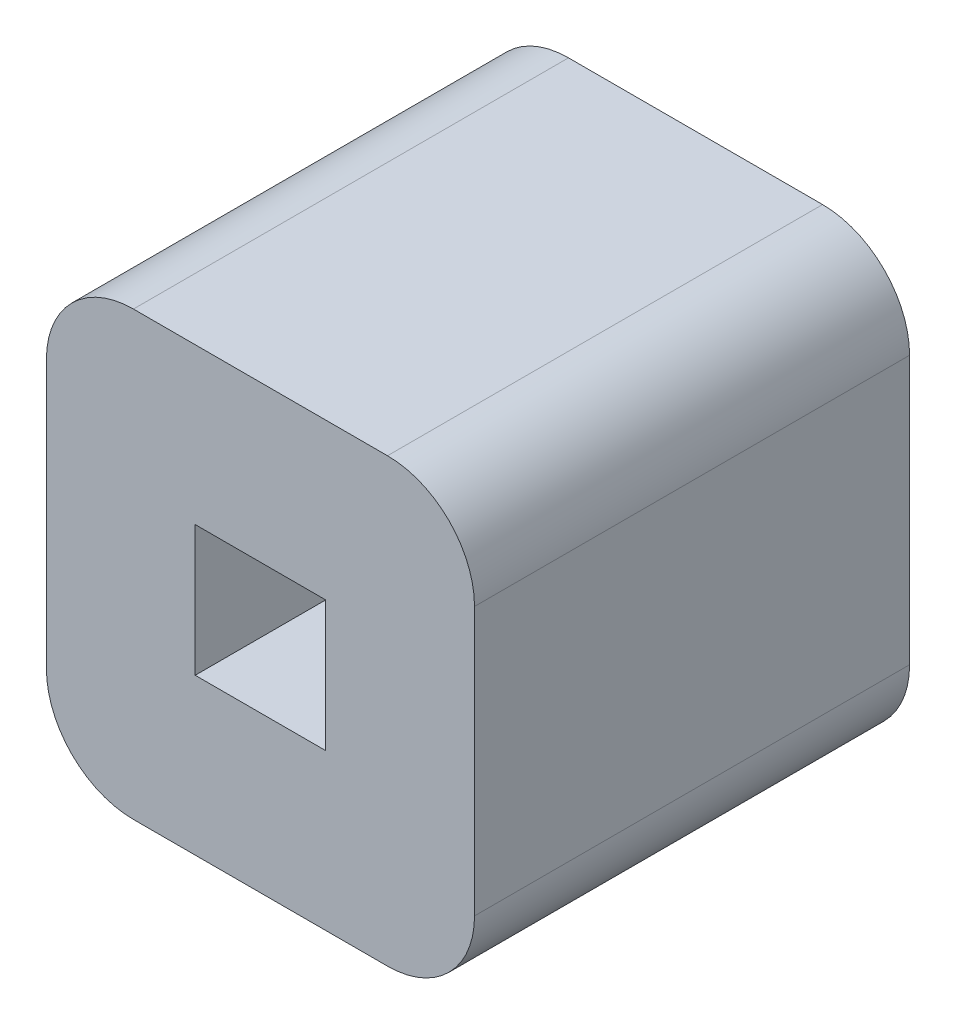
ISO-10303-21;
HEADER;
FILE_DESCRIPTION(('STEP AP214'),'2;1');
FILE_NAME('part.step','',(''),(''),'','','');
FILE_SCHEMA(('AUTOMOTIVE_DESIGN { 1 0 10303 214 1 1 1 1 }'));
ENDSEC;
DATA;
#1=APPLICATION_CONTEXT('core data for automotive mechanical design processes');
#2=APPLICATION_PROTOCOL_DEFINITION('international standard','automotive_design',2000,#1);
#3=PRODUCT_CONTEXT('',#1,'mechanical');
#4=PRODUCT('Part','Part','',(#3));
#5=PRODUCT_RELATED_PRODUCT_CATEGORY('part','',(#4));
#6=PRODUCT_DEFINITION_FORMATION('','',#4);
#7=PRODUCT_DEFINITION_CONTEXT('part definition',#1,'design');
#8=PRODUCT_DEFINITION('design','',#6,#7);
#9=PRODUCT_DEFINITION_SHAPE('','',#8);
#10=(LENGTH_UNIT() NAMED_UNIT(*) SI_UNIT(.MILLI.,.METRE.));
#11=(NAMED_UNIT(*) PLANE_ANGLE_UNIT() SI_UNIT($,.RADIAN.));
#12=(NAMED_UNIT(*) SI_UNIT($,.STERADIAN.) SOLID_ANGLE_UNIT());
#13=UNCERTAINTY_MEASURE_WITH_UNIT(LENGTH_MEASURE(1.E-05),#10,'distance_accuracy_value','');
#14=(GEOMETRIC_REPRESENTATION_CONTEXT(3) GLOBAL_UNCERTAINTY_ASSIGNED_CONTEXT((#13)) GLOBAL_UNIT_ASSIGNED_CONTEXT((#10,
#11,#12)) REPRESENTATION_CONTEXT('',''));
#15=CARTESIAN_POINT('',(0.,0.,0.));
#16=DIRECTION('',(0.,0.,1.));
#17=DIRECTION('',(1.,0.,0.));
#18=AXIS2_PLACEMENT_3D('',#15,#16,#17);
#19=CARTESIAN_POINT('',(1.5403288535176,-0.579832143277619,0.16340157480315));
#20=DIRECTION('',(0.,0.,-1.));
#21=DIRECTION('',(-1.,0.,0.));
#22=AXIS2_PLACEMENT_3D('',#19,#20,#21);
#23=PLANE('',#22);
#24=CARTESIAN_POINT('',(1.35332097950185,-0.604517182647698,0.16340157480315));
#25=DIRECTION('',(0.,0.,-1.));
#26=DIRECTION('',(-1.,0.,0.));
#27=AXIS2_PLACEMENT_3D('',#24,#25,#26);
#28=CIRCLE('',#27,0.0196850393700787);
#29=CARTESIAN_POINT('',(1.33363594013177,-0.604517182647698,0.16340157480315));
#30=VERTEX_POINT('',#29);
#31=CARTESIAN_POINT('',(1.35332097950185,-0.58483214327762,0.16340157480315));
#32=VERTEX_POINT('',#31);
#33=EDGE_CURVE('E152',#30,#32,#28,.T.);
#34=ORIENTED_EDGE('',*,*,#33,.F.);
#35=DIRECTION('',(0.,-1.,0.));
#36=VECTOR('',#35,1.);
#37=CARTESIAN_POINT('',(1.33363594013177,-0.601485686584706,0.16340157480315));
#38=LINE('',#37,#36);
#39=CARTESIAN_POINT('',(1.33363594013177,-0.665147103907541,0.16340157480315));
#40=VERTEX_POINT('',#39);
#41=EDGE_CURVE('E130',#40,#30,#38,.F.);
#42=ORIENTED_EDGE('',*,*,#41,.F.);
#43=CARTESIAN_POINT('',(1.35332097950185,-0.665147103907541,0.16340157480315));
#44=DIRECTION('',(0.,0.,-1.));
#45=DIRECTION('',(-1.,0.,0.));
#46=AXIS2_PLACEMENT_3D('',#43,#44,#45);
#47=CIRCLE('',#46,0.0196850393700787);
#48=CARTESIAN_POINT('',(1.35332097950185,-0.684832143277619,0.16340157480315));
#49=VERTEX_POINT('',#48);
#50=EDGE_CURVE('E156',#49,#40,#47,.T.);
#51=ORIENTED_EDGE('',*,*,#50,.F.);
#52=DIRECTION('',(-1.,0.,0.));
#53=VECTOR('',#52,1.);
#54=CARTESIAN_POINT('',(1.38206113698216,-0.684832143277619,0.16340157480315));
#55=LINE('',#54,#53);
#56=CARTESIAN_POINT('',(1.41080129446248,-0.684832143277619,0.16340157480315));
#57=VERTEX_POINT('',#56);
#58=EDGE_CURVE('E133',#49,#57,#55,.F.);
#59=ORIENTED_EDGE('',*,*,#58,.T.);
#60=CARTESIAN_POINT('',(1.41080129446248,-0.665147103907541,0.16340157480315));
#61=DIRECTION('',(0.,0.,1.));
#62=DIRECTION('',(1.,0.,0.));
#63=AXIS2_PLACEMENT_3D('',#60,#61,#62);
#64=CIRCLE('',#63,0.0196850393700787);
#65=CARTESIAN_POINT('',(1.43048633383256,-0.665147103907541,0.16340157480315));
#66=VERTEX_POINT('',#65);
#67=EDGE_CURVE('E136',#66,#57,#64,.F.);
#68=ORIENTED_EDGE('',*,*,#67,.F.);
#69=DIRECTION('',(0.,-1.,0.));
#70=VECTOR('',#69,1.);
#71=CARTESIAN_POINT('',(1.43048633383256,-0.601485686584706,0.16340157480315));
#72=LINE('',#71,#70);
#73=CARTESIAN_POINT('',(1.43048633383256,-0.604517182647698,0.16340157480315));
#74=VERTEX_POINT('',#73);
#75=EDGE_CURVE('E137',#66,#74,#72,.F.);
#76=ORIENTED_EDGE('',*,*,#75,.T.);
#77=CARTESIAN_POINT('',(1.41080129446248,-0.604517182647698,0.16340157480315));
#78=DIRECTION('',(0.,0.,1.));
#79=DIRECTION('',(1.,0.,0.));
#80=AXIS2_PLACEMENT_3D('',#77,#78,#79);
#81=CIRCLE('',#80,0.0196850393700787);
#82=CARTESIAN_POINT('',(1.41080129446248,-0.58483214327762,0.16340157480315));
#83=VERTEX_POINT('',#82);
#84=EDGE_CURVE('E20',#83,#74,#81,.F.);
#85=ORIENTED_EDGE('',*,*,#84,.F.);
#86=DIRECTION('',(1.,0.,0.));
#87=VECTOR('',#86,1.);
#88=CARTESIAN_POINT('',(1.38206113698216,-0.58483214327762,0.16340157480315));
#89=LINE('',#88,#87);
#90=EDGE_CURVE('E84',#83,#32,#89,.F.);
#91=ORIENTED_EDGE('',*,*,#90,.T.);
#92=EDGE_LOOP('',(#34,#42,#51,#59,#68,#76,#85,#91));
#93=FACE_BOUND('',#92,.T.);
#94=DIRECTION('',(1.,0.,0.));
#95=VECTOR('',#94,1.);
#96=CARTESIAN_POINT('',(1.36582097950185,-0.62006836375006,0.16340157480315));
#97=LINE('',#96,#95);
#98=CARTESIAN_POINT('',(1.39682491650972,-0.62006836375006,0.16340157480315));
#99=VERTEX_POINT('',#98);
#100=CARTESIAN_POINT('',(1.3672973574546,-0.62006836375006,0.16340157480315));
#101=VERTEX_POINT('',#100);
#102=EDGE_CURVE('E173',#99,#101,#97,.F.);
#103=ORIENTED_EDGE('',*,*,#102,.F.);
#104=DIRECTION('',(0.,1.,0.));
#105=VECTOR('',#104,1.);
#106=CARTESIAN_POINT('',(1.39682491650972,-0.651072300757934,0.16340157480315));
#107=LINE('',#106,#105);
#108=CARTESIAN_POINT('',(1.39682491650972,-0.649595922805179,0.16340157480315));
#109=VERTEX_POINT('',#108);
#110=EDGE_CURVE('E103',#99,#109,#107,.F.);
#111=ORIENTED_EDGE('',*,*,#110,.T.);
#112=DIRECTION('',(-1.,0.,0.));
#113=VECTOR('',#112,1.);
#114=CARTESIAN_POINT('',(1.39830129446248,-0.649595922805179,0.16340157480315));
#115=LINE('',#114,#113);
#116=CARTESIAN_POINT('',(1.3672973574546,-0.649595922805179,0.16340157480315));
#117=VERTEX_POINT('',#116);
#118=EDGE_CURVE('E116',#117,#109,#115,.F.);
#119=ORIENTED_EDGE('',*,*,#118,.F.);
#120=DIRECTION('',(0.,1.,0.));
#121=VECTOR('',#120,1.);
#122=CARTESIAN_POINT('',(1.3672973574546,-0.651072300757934,0.16340157480315));
#123=LINE('',#122,#121);
#124=EDGE_CURVE('E94',#101,#117,#123,.F.);
#125=ORIENTED_EDGE('',*,*,#124,.F.);
#126=EDGE_LOOP('',(#103,#111,#119,#125));
#127=FACE_BOUND('',#126,.T.);
#128=ADVANCED_FACE('F17',(#93,#127),#23,.F.);
#129=CARTESIAN_POINT('',(1.3672973574546,-0.651072300757934,0.152181102362205));
#130=DIRECTION('',(1.,0.,0.));
#131=DIRECTION('',(0.,1.,0.));
#132=AXIS2_PLACEMENT_3D('',#129,#130,#131);
#133=PLANE('',#132);
#134=ORIENTED_EDGE('',*,*,#124,.T.);
#135=DIRECTION('',(0.,0.,1.));
#136=VECTOR('',#135,1.);
#137=CARTESIAN_POINT('',(1.3672973574546,-0.649595922805179,0.152181102362205));
#138=LINE('',#137,#136);
#139=CARTESIAN_POINT('',(1.3672973574546,-0.649595922805179,0.0649763779527558));
#140=VERTEX_POINT('',#139);
#141=EDGE_CURVE('E110',#140,#117,#138,.T.);
#142=ORIENTED_EDGE('',*,*,#141,.F.);
#143=DIRECTION('',(0.,1.,0.));
#144=VECTOR('',#143,1.);
#145=CARTESIAN_POINT('',(1.3672973574546,-0.579832143277619,0.0649763779527558));
#146=LINE('',#145,#144);
#147=CARTESIAN_POINT('',(1.3672973574546,-0.62006836375006,0.0649763779527558));
#148=VERTEX_POINT('',#147);
#149=EDGE_CURVE('E193',#148,#140,#146,.F.);
#150=ORIENTED_EDGE('',*,*,#149,.F.);
#151=DIRECTION('',(0.,0.,1.));
#152=VECTOR('',#151,1.);
#153=CARTESIAN_POINT('',(1.3672973574546,-0.62006836375006,0.152181102362205));
#154=LINE('',#153,#152);
#155=EDGE_CURVE('E113',#101,#148,#154,.F.);
#156=ORIENTED_EDGE('',*,*,#155,.F.);
#157=EDGE_LOOP('',(#134,#142,#150,#156));
#158=FACE_BOUND('',#157,.T.);
#159=ADVANCED_FACE('F107',(#158),#133,.T.);
#160=CARTESIAN_POINT('',(1.39830129446248,-0.649595922805179,0.152181102362205));
#161=DIRECTION('',(0.,1.,0.));
#162=DIRECTION('',(-1.,0.,0.));
#163=AXIS2_PLACEMENT_3D('',#160,#161,#162);
#164=PLANE('',#163);
#165=ORIENTED_EDGE('',*,*,#118,.T.);
#166=DIRECTION('',(0.,0.,1.));
#167=VECTOR('',#166,1.);
#168=CARTESIAN_POINT('',(1.39682491650972,-0.649595922805179,0.152181102362205));
#169=LINE('',#168,#167);
#170=CARTESIAN_POINT('',(1.39682491650972,-0.649595922805179,0.0649763779527558));
#171=VERTEX_POINT('',#170);
#172=EDGE_CURVE('E178',#109,#171,#169,.F.);
#173=ORIENTED_EDGE('',*,*,#172,.T.);
#174=DIRECTION('',(-1.,0.,0.));
#175=VECTOR('',#174,1.);
#176=CARTESIAN_POINT('',(1.5403288535176,-0.649595922805179,0.0649763779527558));
#177=LINE('',#176,#175);
#178=EDGE_CURVE('E123',#140,#171,#177,.F.);
#179=ORIENTED_EDGE('',*,*,#178,.F.);
#180=ORIENTED_EDGE('',*,*,#141,.T.);
#181=EDGE_LOOP('',(#165,#173,#179,#180));
#182=FACE_BOUND('',#181,.T.);
#183=ADVANCED_FACE('F121',(#182),#164,.T.);
#184=CARTESIAN_POINT('',(1.39682491650972,-0.651072300757934,0.152181102362205));
#185=DIRECTION('',(1.,0.,0.));
#186=DIRECTION('',(0.,1.,0.));
#187=AXIS2_PLACEMENT_3D('',#184,#185,#186);
#188=PLANE('',#187);
#189=ORIENTED_EDGE('',*,*,#172,.F.);
#190=ORIENTED_EDGE('',*,*,#110,.F.);
#191=DIRECTION('',(0.,0.,1.));
#192=VECTOR('',#191,1.);
#193=CARTESIAN_POINT('',(1.39682491650972,-0.62006836375006,0.152181102362205));
#194=LINE('',#193,#192);
#195=CARTESIAN_POINT('',(1.39682491650972,-0.62006836375006,0.0649763779527558));
#196=VERTEX_POINT('',#195);
#197=EDGE_CURVE('E175',#196,#99,#194,.T.);
#198=ORIENTED_EDGE('',*,*,#197,.F.);
#199=DIRECTION('',(0.,1.,0.));
#200=VECTOR('',#199,1.);
#201=CARTESIAN_POINT('',(1.39682491650972,-0.579832143277619,0.0649763779527558));
#202=LINE('',#201,#200);
#203=EDGE_CURVE('E185',#171,#196,#202,.T.);
#204=ORIENTED_EDGE('',*,*,#203,.F.);
#205=EDGE_LOOP('',(#189,#190,#198,#204));
#206=FACE_BOUND('',#205,.T.);
#207=ADVANCED_FACE('F186',(#206),#188,.F.);
#208=CARTESIAN_POINT('',(1.36582097950185,-0.62006836375006,0.152181102362205));
#209=DIRECTION('',(0.,-1.,0.));
#210=DIRECTION('',(1.,0.,0.));
#211=AXIS2_PLACEMENT_3D('',#208,#209,#210);
#212=PLANE('',#211);
#213=ORIENTED_EDGE('',*,*,#102,.T.);
#214=ORIENTED_EDGE('',*,*,#155,.T.);
#215=DIRECTION('',(-1.,0.,0.));
#216=VECTOR('',#215,1.);
#217=CARTESIAN_POINT('',(1.5403288535176,-0.62006836375006,0.0649763779527558));
#218=LINE('',#217,#216);
#219=EDGE_CURVE('E190',#196,#148,#218,.T.);
#220=ORIENTED_EDGE('',*,*,#219,.F.);
#221=ORIENTED_EDGE('',*,*,#197,.T.);
#222=EDGE_LOOP('',(#213,#214,#220,#221));
#223=FACE_BOUND('',#222,.T.);
#224=ADVANCED_FACE('F223',(#223),#212,.T.);
#225=CARTESIAN_POINT('',(1.38206113698216,-0.58483214327762,0.114188976377953));
#226=DIRECTION('',(0.,-1.,0.));
#227=DIRECTION('',(1.,0.,0.));
#228=AXIS2_PLACEMENT_3D('',#225,#226,#227);
#229=PLANE('',#228);
#230=DIRECTION('',(0.,0.,-1.));
#231=VECTOR('',#230,1.);
#232=CARTESIAN_POINT('',(1.35332097950185,-0.584832143277619,0.168322834645669));
#233=LINE('',#232,#231);
#234=CARTESIAN_POINT('',(1.35332097950185,-0.58483214327762,0.0649763779527558));
#235=VERTEX_POINT('',#234);
#236=EDGE_CURVE('E155',#32,#235,#233,.T.);
#237=ORIENTED_EDGE('',*,*,#236,.F.);
#238=ORIENTED_EDGE('',*,*,#90,.F.);
#239=DIRECTION('',(0.,0.,1.));
#240=VECTOR('',#239,1.);
#241=CARTESIAN_POINT('',(1.41080129446248,-0.584832143277619,0.168322834645669));
#242=LINE('',#241,#240);
#243=CARTESIAN_POINT('',(1.41080129446248,-0.58483214327762,0.0649763779527558));
#244=VERTEX_POINT('',#243);
#245=EDGE_CURVE('E129',#244,#83,#242,.T.);
#246=ORIENTED_EDGE('',*,*,#245,.F.);
#247=DIRECTION('',(-1.,0.,0.));
#248=VECTOR('',#247,1.);
#249=CARTESIAN_POINT('',(1.5403288535176,-0.58483214327762,0.0649763779527558));
#250=LINE('',#249,#248);
#251=EDGE_CURVE('E151',#235,#244,#250,.F.);
#252=ORIENTED_EDGE('',*,*,#251,.F.);
#253=EDGE_LOOP('',(#237,#238,#246,#252));
#254=FACE_BOUND('',#253,.T.);
#255=ADVANCED_FACE('F226',(#254),#229,.F.);
#256=CARTESIAN_POINT('',(1.41080129446248,-0.604517182647698,0.168322834645669));
#257=DIRECTION('',(0.,0.,1.));
#258=DIRECTION('',(1.,0.,0.));
#259=AXIS2_PLACEMENT_3D('',#256,#257,#258);
#260=CYLINDRICAL_SURFACE('',#259,0.0196850393700787);
#261=ORIENTED_EDGE('',*,*,#84,.T.);
#262=DIRECTION('',(0.,0.,1.));
#263=VECTOR('',#262,1.);
#264=CARTESIAN_POINT('',(1.43048633383256,-0.604517182647698,0.0600551181102362));
#265=LINE('',#264,#263);
#266=CARTESIAN_POINT('',(1.43048633383256,-0.604517182647698,0.0649763779527558));
#267=VERTEX_POINT('',#266);
#268=EDGE_CURVE('E138',#74,#267,#265,.F.);
#269=ORIENTED_EDGE('',*,*,#268,.T.);
#270=CARTESIAN_POINT('',(1.41080129446248,-0.604517182647698,0.0649763779527558));
#271=DIRECTION('',(0.,0.,1.));
#272=DIRECTION('',(1.,0.,0.));
#273=AXIS2_PLACEMENT_3D('',#270,#271,#272);
#274=CIRCLE('',#273,0.0196850393700787);
#275=EDGE_CURVE('E148',#244,#267,#274,.F.);
#276=ORIENTED_EDGE('',*,*,#275,.F.);
#277=ORIENTED_EDGE('',*,*,#245,.T.);
#278=EDGE_LOOP('',(#261,#269,#276,#277));
#279=FACE_BOUND('',#278,.T.);
#280=ADVANCED_FACE('F233',(#279),#260,.T.);
#281=CARTESIAN_POINT('',(1.43048633383256,-0.601485686584706,0.0600551181102362));
#282=DIRECTION('',(-1.,0.,0.));
#283=DIRECTION('',(0.,-1.,0.));
#284=AXIS2_PLACEMENT_3D('',#281,#282,#283);
#285=PLANE('',#284);
#286=ORIENTED_EDGE('',*,*,#268,.F.);
#287=ORIENTED_EDGE('',*,*,#75,.F.);
#288=DIRECTION('',(0.,0.,1.));
#289=VECTOR('',#288,1.);
#290=CARTESIAN_POINT('',(1.43048633383256,-0.665147103907541,0.168322834645669));
#291=LINE('',#290,#289);
#292=CARTESIAN_POINT('',(1.43048633383256,-0.665147103907541,0.0649763779527558));
#293=VERTEX_POINT('',#292);
#294=EDGE_CURVE('E159',#293,#66,#291,.T.);
#295=ORIENTED_EDGE('',*,*,#294,.F.);
#296=DIRECTION('',(0.,1.,0.));
#297=VECTOR('',#296,1.);
#298=CARTESIAN_POINT('',(1.43048633383256,-0.579832143277619,0.0649763779527558));
#299=LINE('',#298,#297);
#300=EDGE_CURVE('E147',#267,#293,#299,.F.);
#301=ORIENTED_EDGE('',*,*,#300,.F.);
#302=EDGE_LOOP('',(#286,#287,#295,#301));
#303=FACE_BOUND('',#302,.T.);
#304=ADVANCED_FACE('F255',(#303),#285,.F.);
#305=CARTESIAN_POINT('',(1.41080129446248,-0.665147103907541,0.168322834645669));
#306=DIRECTION('',(0.,0.,1.));
#307=DIRECTION('',(1.,0.,0.));
#308=AXIS2_PLACEMENT_3D('',#305,#306,#307);
#309=CYLINDRICAL_SURFACE('',#308,0.0196850393700787);
#310=ORIENTED_EDGE('',*,*,#67,.T.);
#311=DIRECTION('',(0.,0.,1.));
#312=VECTOR('',#311,1.);
#313=CARTESIAN_POINT('',(1.41080129446248,-0.684832143277619,0.114188976377953));
#314=LINE('',#313,#312);
#315=CARTESIAN_POINT('',(1.41080129446248,-0.684832143277619,0.0649763779527558));
#316=VERTEX_POINT('',#315);
#317=EDGE_CURVE('E135',#57,#316,#314,.F.);
#318=ORIENTED_EDGE('',*,*,#317,.T.);
#319=CARTESIAN_POINT('',(1.41080129446248,-0.665147103907541,0.0649763779527558));
#320=DIRECTION('',(0.,0.,1.));
#321=DIRECTION('',(1.,0.,0.));
#322=AXIS2_PLACEMENT_3D('',#319,#320,#321);
#323=CIRCLE('',#322,0.0196850393700787);
#324=EDGE_CURVE('E144',#293,#316,#323,.F.);
#325=ORIENTED_EDGE('',*,*,#324,.F.);
#326=ORIENTED_EDGE('',*,*,#294,.T.);
#327=EDGE_LOOP('',(#310,#318,#325,#326));
#328=FACE_BOUND('',#327,.T.);
#329=ADVANCED_FACE('F206',(#328),#309,.T.);
#330=CARTESIAN_POINT('',(1.38206113698216,-0.684832143277619,0.114188976377953));
#331=DIRECTION('',(0.,1.,0.));
#332=DIRECTION('',(-1.,0.,0.));
#333=AXIS2_PLACEMENT_3D('',#330,#331,#332);
#334=PLANE('',#333);
#335=DIRECTION('',(-1.,0.,0.));
#336=VECTOR('',#335,1.);
#337=CARTESIAN_POINT('',(1.5403288535176,-0.684832143277619,0.0649763779527558));
#338=LINE('',#337,#336);
#339=CARTESIAN_POINT('',(1.35332097950185,-0.684832143277619,0.0649763779527558));
#340=VERTEX_POINT('',#339);
#341=EDGE_CURVE('E143',#316,#340,#338,.T.);
#342=ORIENTED_EDGE('',*,*,#341,.F.);
#343=ORIENTED_EDGE('',*,*,#317,.F.);
#344=ORIENTED_EDGE('',*,*,#58,.F.);
#345=DIRECTION('',(0.,0.,-1.));
#346=VECTOR('',#345,1.);
#347=CARTESIAN_POINT('',(1.35332097950185,-0.68483214327762,0.168322834645669));
#348=LINE('',#347,#346);
#349=EDGE_CURVE('E157',#340,#49,#348,.F.);
#350=ORIENTED_EDGE('',*,*,#349,.F.);
#351=EDGE_LOOP('',(#342,#343,#344,#350));
#352=FACE_BOUND('',#351,.T.);
#353=ADVANCED_FACE('F210',(#352),#334,.F.);
#354=CARTESIAN_POINT('',(1.35332097950185,-0.665147103907541,0.168322834645669));
#355=DIRECTION('',(0.,0.,-1.));
#356=DIRECTION('',(-1.,0.,0.));
#357=AXIS2_PLACEMENT_3D('',#354,#355,#356);
#358=CYLINDRICAL_SURFACE('',#357,0.0196850393700787);
#359=ORIENTED_EDGE('',*,*,#50,.T.);
#360=DIRECTION('',(0.,0.,1.));
#361=VECTOR('',#360,1.);
#362=CARTESIAN_POINT('',(1.33363594013177,-0.665147103907541,0.0600551181102362));
#363=LINE('',#362,#361);
#364=CARTESIAN_POINT('',(1.33363594013177,-0.665147103907541,0.0649763779527558));
#365=VERTEX_POINT('',#364);
#366=EDGE_CURVE('E132',#365,#40,#363,.T.);
#367=ORIENTED_EDGE('',*,*,#366,.F.);
#368=CARTESIAN_POINT('',(1.35332097950185,-0.665147103907541,0.0649763779527558));
#369=DIRECTION('',(0.,0.,-1.));
#370=DIRECTION('',(-1.,0.,0.));
#371=AXIS2_PLACEMENT_3D('',#368,#369,#370);
#372=CIRCLE('',#371,0.0196850393700787);
#373=EDGE_CURVE('E140',#340,#365,#372,.T.);
#374=ORIENTED_EDGE('',*,*,#373,.F.);
#375=ORIENTED_EDGE('',*,*,#349,.T.);
#376=EDGE_LOOP('',(#359,#367,#374,#375));
#377=FACE_BOUND('',#376,.T.);
#378=ADVANCED_FACE('F248',(#377),#358,.T.);
#379=CARTESIAN_POINT('',(1.33363594013177,-0.601485686584706,0.0600551181102362));
#380=DIRECTION('',(-1.,0.,0.));
#381=DIRECTION('',(0.,-1.,0.));
#382=AXIS2_PLACEMENT_3D('',#379,#380,#381);
#383=PLANE('',#382);
#384=ORIENTED_EDGE('',*,*,#41,.T.);
#385=DIRECTION('',(0.,0.,-1.));
#386=VECTOR('',#385,1.);
#387=CARTESIAN_POINT('',(1.33363594013177,-0.604517182647698,0.168322834645669));
#388=LINE('',#387,#386);
#389=CARTESIAN_POINT('',(1.33363594013177,-0.604517182647698,0.0649763779527558));
#390=VERTEX_POINT('',#389);
#391=EDGE_CURVE('E35',#390,#30,#388,.F.);
#392=ORIENTED_EDGE('',*,*,#391,.F.);
#393=DIRECTION('',(0.,1.,0.));
#394=VECTOR('',#393,1.);
#395=CARTESIAN_POINT('',(1.33363594013177,-0.579832143277619,0.0649763779527558));
#396=LINE('',#395,#394);
#397=EDGE_CURVE('E26',#365,#390,#396,.T.);
#398=ORIENTED_EDGE('',*,*,#397,.F.);
#399=ORIENTED_EDGE('',*,*,#366,.T.);
#400=EDGE_LOOP('',(#384,#392,#398,#399));
#401=FACE_BOUND('',#400,.T.);
#402=ADVANCED_FACE('F242',(#401),#383,.T.);
#403=CARTESIAN_POINT('',(1.35332097950185,-0.604517182647698,0.168322834645669));
#404=DIRECTION('',(0.,0.,-1.));
#405=DIRECTION('',(-1.,0.,0.));
#406=AXIS2_PLACEMENT_3D('',#403,#404,#405);
#407=CYLINDRICAL_SURFACE('',#406,0.0196850393700787);
#408=ORIENTED_EDGE('',*,*,#33,.T.);
#409=ORIENTED_EDGE('',*,*,#236,.T.);
#410=CARTESIAN_POINT('',(1.35332097950185,-0.604517182647698,0.0649763779527558));
#411=DIRECTION('',(0.,0.,-1.));
#412=DIRECTION('',(-1.,0.,0.));
#413=AXIS2_PLACEMENT_3D('',#410,#411,#412);
#414=CIRCLE('',#413,0.0196850393700787);
#415=EDGE_CURVE('E11',#390,#235,#414,.T.);
#416=ORIENTED_EDGE('',*,*,#415,.F.);
#417=ORIENTED_EDGE('',*,*,#391,.T.);
#418=EDGE_LOOP('',(#408,#409,#416,#417));
#419=FACE_BOUND('',#418,.T.);
#420=ADVANCED_FACE('F237',(#419),#407,.T.);
#421=CARTESIAN_POINT('',(1.5403288535176,-0.579832143277619,0.0649763779527558));
#422=DIRECTION('',(0.,0.,-1.));
#423=DIRECTION('',(-1.,0.,0.));
#424=AXIS2_PLACEMENT_3D('',#421,#422,#423);
#425=PLANE('',#424);
#426=ORIENTED_EDGE('',*,*,#397,.T.);
#427=ORIENTED_EDGE('',*,*,#415,.T.);
#428=ORIENTED_EDGE('',*,*,#251,.T.);
#429=ORIENTED_EDGE('',*,*,#275,.T.);
#430=ORIENTED_EDGE('',*,*,#300,.T.);
#431=ORIENTED_EDGE('',*,*,#324,.T.);
#432=ORIENTED_EDGE('',*,*,#341,.T.);
#433=ORIENTED_EDGE('',*,*,#373,.T.);
#434=EDGE_LOOP('',(#426,#427,#428,#429,#430,#431,#432,#433));
#435=FACE_BOUND('',#434,.T.);
#436=ORIENTED_EDGE('',*,*,#203,.T.);
#437=ORIENTED_EDGE('',*,*,#219,.T.);
#438=ORIENTED_EDGE('',*,*,#149,.T.);
#439=ORIENTED_EDGE('',*,*,#178,.T.);
#440=EDGE_LOOP('',(#436,#437,#438,#439));
#441=FACE_BOUND('',#440,.T.);
#442=ADVANCED_FACE('F192',(#435,#441),#425,.T.);
#443=CLOSED_SHELL('',(#128,#159,#183,#207,#224,#255,#280,#304,#329,#353,#378,#402,#420,#442));
#444=MANIFOLD_SOLID_BREP('B1',#443);
#445=ADVANCED_BREP_SHAPE_REPRESENTATION('',(#18,#444),#14);
#446=SHAPE_DEFINITION_REPRESENTATION(#9,#445);
ENDSEC;
END-ISO-10303-21;
